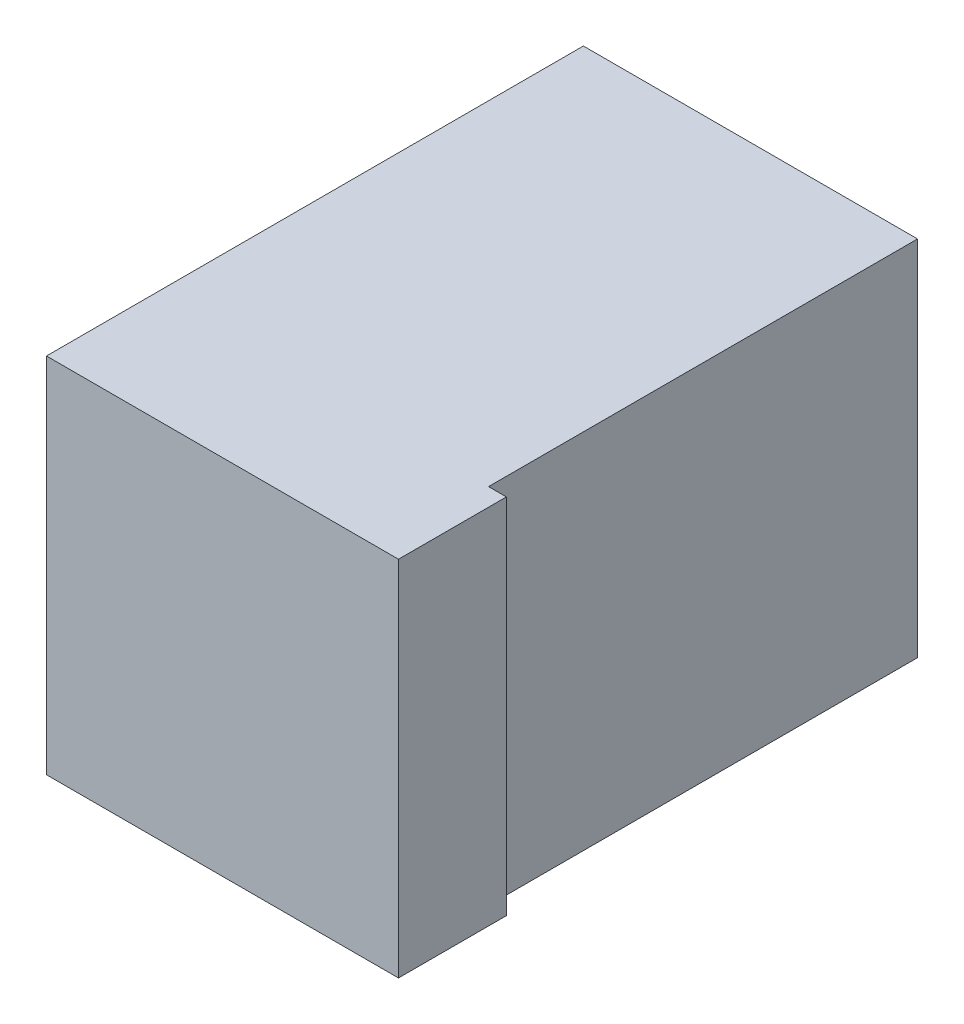
ISO-10303-21;
HEADER;
FILE_DESCRIPTION(('STEP AP214'),'2;1');
FILE_NAME('part.step','',(''),(''),'','','');
FILE_SCHEMA(('AUTOMOTIVE_DESIGN { 1 0 10303 214 1 1 1 1 }'));
ENDSEC;
DATA;
#1=APPLICATION_CONTEXT('core data for automotive mechanical design processes');
#2=APPLICATION_PROTOCOL_DEFINITION('international standard','automotive_design',2000,#1);
#3=PRODUCT_CONTEXT('',#1,'mechanical');
#4=PRODUCT('Part','Part','',(#3));
#5=PRODUCT_RELATED_PRODUCT_CATEGORY('part','',(#4));
#6=PRODUCT_DEFINITION_FORMATION('','',#4);
#7=PRODUCT_DEFINITION_CONTEXT('part definition',#1,'design');
#8=PRODUCT_DEFINITION('design','',#6,#7);
#9=PRODUCT_DEFINITION_SHAPE('','',#8);
#10=(LENGTH_UNIT() NAMED_UNIT(*) SI_UNIT(.MILLI.,.METRE.));
#11=(NAMED_UNIT(*) PLANE_ANGLE_UNIT() SI_UNIT($,.RADIAN.));
#12=(NAMED_UNIT(*) SI_UNIT($,.STERADIAN.) SOLID_ANGLE_UNIT());
#13=UNCERTAINTY_MEASURE_WITH_UNIT(LENGTH_MEASURE(1.E-05),#10,'distance_accuracy_value','');
#14=(GEOMETRIC_REPRESENTATION_CONTEXT(3) GLOBAL_UNCERTAINTY_ASSIGNED_CONTEXT((#13)) GLOBAL_UNIT_ASSIGNED_CONTEXT((#10,
#11,#12)) REPRESENTATION_CONTEXT('',''));
#15=CARTESIAN_POINT('',(0.,0.,0.));
#16=DIRECTION('',(0.,0.,1.));
#17=DIRECTION('',(1.,0.,0.));
#18=AXIS2_PLACEMENT_3D('',#15,#16,#17);
#19=CARTESIAN_POINT('',(0.,0.,151.));
#20=DIRECTION('',(-1.,0.,0.));
#21=DIRECTION('',(0.,-1.,0.));
#22=AXIS2_PLACEMENT_3D('',#19,#20,#21);
#23=PLANE('',#22);
#24=DIRECTION('',(0.,0.,-1.));
#25=VECTOR('',#24,1.);
#26=CARTESIAN_POINT('',(0.,-102.,151.));
#27=LINE('',#26,#25);
#28=CARTESIAN_POINT('',(0.,-102.,151.));
#29=VERTEX_POINT('',#28);
#30=CARTESIAN_POINT('',(0.,-102.,120.65));
#31=VERTEX_POINT('',#30);
#32=EDGE_CURVE('E114',#29,#31,#27,.T.);
#33=ORIENTED_EDGE('',*,*,#32,.T.);
#34=DIRECTION('',(0.,-1.,0.));
#35=VECTOR('',#34,1.);
#36=CARTESIAN_POINT('',(0.,50.4,120.65));
#37=LINE('',#36,#35);
#38=CARTESIAN_POINT('',(0.,0.,120.65));
#39=VERTEX_POINT('',#38);
#40=EDGE_CURVE('E99',#39,#31,#37,.T.);
#41=ORIENTED_EDGE('',*,*,#40,.F.);
#42=DIRECTION('',(0.,0.,-1.));
#43=VECTOR('',#42,1.);
#44=CARTESIAN_POINT('',(0.,0.,151.));
#45=LINE('',#44,#43);
#46=CARTESIAN_POINT('',(0.,0.,151.));
#47=VERTEX_POINT('',#46);
#48=EDGE_CURVE('E44',#47,#39,#45,.T.);
#49=ORIENTED_EDGE('',*,*,#48,.F.);
#50=DIRECTION('',(0.,1.,0.));
#51=VECTOR('',#50,1.);
#52=CARTESIAN_POINT('',(0.,0.,151.));
#53=LINE('',#52,#51);
#54=EDGE_CURVE('E117',#29,#47,#53,.T.);
#55=ORIENTED_EDGE('',*,*,#54,.F.);
#56=EDGE_LOOP('',(#33,#41,#49,#55));
#57=FACE_BOUND('',#56,.T.);
#58=ADVANCED_FACE('F37',(#57),#23,.F.);
#59=CARTESIAN_POINT('',(0.,0.,151.));
#60=DIRECTION('',(0.,-1.,0.));
#61=DIRECTION('',(0.,0.,-1.));
#62=AXIS2_PLACEMENT_3D('',#59,#60,#61);
#63=PLANE('',#62);
#64=DIRECTION('',(-1.,0.,0.));
#65=VECTOR('',#64,1.);
#66=CARTESIAN_POINT('',(0.,0.,120.65));
#67=LINE('',#66,#65);
#68=CARTESIAN_POINT('',(-5.02,0.,120.65));
#69=VERTEX_POINT('',#68);
#70=EDGE_CURVE('E105',#39,#69,#67,.T.);
#71=ORIENTED_EDGE('',*,*,#70,.T.);
#72=DIRECTION('',(0.,0.,-1.));
#73=VECTOR('',#72,1.);
#74=CARTESIAN_POINT('',(-5.02,0.,151.));
#75=LINE('',#74,#73);
#76=CARTESIAN_POINT('',(-5.02,0.,0.));
#77=VERTEX_POINT('',#76);
#78=EDGE_CURVE('E130',#69,#77,#75,.T.);
#79=ORIENTED_EDGE('',*,*,#78,.T.);
#80=DIRECTION('',(-1.,0.,0.));
#81=VECTOR('',#80,1.);
#82=CARTESIAN_POINT('',(0.,0.,0.));
#83=LINE('',#82,#81);
#84=CARTESIAN_POINT('',(-99.,0.,0.));
#85=VERTEX_POINT('',#84);
#86=EDGE_CURVE('E132',#77,#85,#83,.T.);
#87=ORIENTED_EDGE('',*,*,#86,.T.);
#88=DIRECTION('',(0.,0.,-1.));
#89=VECTOR('',#88,1.);
#90=CARTESIAN_POINT('',(-99.,0.,151.));
#91=LINE('',#90,#89);
#92=CARTESIAN_POINT('',(-99.,0.,151.));
#93=VERTEX_POINT('',#92);
#94=EDGE_CURVE('E120',#93,#85,#91,.T.);
#95=ORIENTED_EDGE('',*,*,#94,.F.);
#96=DIRECTION('',(-1.,0.,0.));
#97=VECTOR('',#96,1.);
#98=CARTESIAN_POINT('',(0.,0.,151.));
#99=LINE('',#98,#97);
#100=EDGE_CURVE('E83',#47,#93,#99,.T.);
#101=ORIENTED_EDGE('',*,*,#100,.F.);
#102=ORIENTED_EDGE('',*,*,#48,.T.);
#103=EDGE_LOOP('',(#71,#79,#87,#95,#101,#102));
#104=FACE_BOUND('',#103,.T.);
#105=ADVANCED_FACE('F128',(#104),#63,.F.);
#106=CARTESIAN_POINT('',(-99.,0.,151.));
#107=DIRECTION('',(1.,0.,0.));
#108=DIRECTION('',(0.,1.,0.));
#109=AXIS2_PLACEMENT_3D('',#106,#107,#108);
#110=PLANE('',#109);
#111=DIRECTION('',(0.,-1.,0.));
#112=VECTOR('',#111,1.);
#113=CARTESIAN_POINT('',(-99.,0.,0.));
#114=LINE('',#113,#112);
#115=CARTESIAN_POINT('',(-99.,-102.,0.));
#116=VERTEX_POINT('',#115);
#117=EDGE_CURVE('E75',#85,#116,#114,.T.);
#118=ORIENTED_EDGE('',*,*,#117,.T.);
#119=DIRECTION('',(0.,0.,-1.));
#120=VECTOR('',#119,1.);
#121=CARTESIAN_POINT('',(-99.,-102.,151.));
#122=LINE('',#121,#120);
#123=CARTESIAN_POINT('',(-99.,-102.,151.));
#124=VERTEX_POINT('',#123);
#125=EDGE_CURVE('E118',#124,#116,#122,.T.);
#126=ORIENTED_EDGE('',*,*,#125,.F.);
#127=DIRECTION('',(0.,-1.,0.));
#128=VECTOR('',#127,1.);
#129=CARTESIAN_POINT('',(-99.,0.,151.));
#130=LINE('',#129,#128);
#131=EDGE_CURVE('E122',#93,#124,#130,.T.);
#132=ORIENTED_EDGE('',*,*,#131,.F.);
#133=ORIENTED_EDGE('',*,*,#94,.T.);
#134=EDGE_LOOP('',(#118,#126,#132,#133));
#135=FACE_BOUND('',#134,.T.);
#136=ADVANCED_FACE('F155',(#135),#110,.F.);
#137=CARTESIAN_POINT('',(0.,-102.,151.));
#138=DIRECTION('',(0.,1.,0.));
#139=DIRECTION('',(-1.,0.,0.));
#140=AXIS2_PLACEMENT_3D('',#137,#138,#139);
#141=PLANE('',#140);
#142=DIRECTION('',(1.,0.,0.));
#143=VECTOR('',#142,1.);
#144=CARTESIAN_POINT('',(0.,-102.,0.));
#145=LINE('',#144,#143);
#146=CARTESIAN_POINT('',(-5.01999999999998,-102.,0.));
#147=VERTEX_POINT('',#146);
#148=EDGE_CURVE('E125',#116,#147,#145,.T.);
#149=ORIENTED_EDGE('',*,*,#148,.T.);
#150=DIRECTION('',(0.,0.,-1.));
#151=VECTOR('',#150,1.);
#152=CARTESIAN_POINT('',(-5.01999999999998,-102.,0.));
#153=LINE('',#152,#151);
#154=CARTESIAN_POINT('',(-5.01999999999998,-102.,120.65));
#155=VERTEX_POINT('',#154);
#156=EDGE_CURVE('E50',#155,#147,#153,.T.);
#157=ORIENTED_EDGE('',*,*,#156,.F.);
#158=DIRECTION('',(-1.,0.,0.));
#159=VECTOR('',#158,1.);
#160=CARTESIAN_POINT('',(0.,-102.,120.65));
#161=LINE('',#160,#159);
#162=EDGE_CURVE('E103',#31,#155,#161,.T.);
#163=ORIENTED_EDGE('',*,*,#162,.F.);
#164=ORIENTED_EDGE('',*,*,#32,.F.);
#165=DIRECTION('',(1.,0.,0.));
#166=VECTOR('',#165,1.);
#167=CARTESIAN_POINT('',(0.,-102.,151.));
#168=LINE('',#167,#166);
#169=EDGE_CURVE('E59',#124,#29,#168,.T.);
#170=ORIENTED_EDGE('',*,*,#169,.F.);
#171=ORIENTED_EDGE('',*,*,#125,.T.);
#172=EDGE_LOOP('',(#149,#157,#163,#164,#170,#171));
#173=FACE_BOUND('',#172,.T.);
#174=ADVANCED_FACE('F113',(#173),#141,.F.);
#175=CARTESIAN_POINT('',(0.,0.,151.));
#176=DIRECTION('',(0.,0.,-1.));
#177=DIRECTION('',(-1.,0.,0.));
#178=AXIS2_PLACEMENT_3D('',#175,#176,#177);
#179=PLANE('',#178);
#180=ORIENTED_EDGE('',*,*,#54,.T.);
#181=ORIENTED_EDGE('',*,*,#100,.T.);
#182=ORIENTED_EDGE('',*,*,#131,.T.);
#183=ORIENTED_EDGE('',*,*,#169,.T.);
#184=EDGE_LOOP('',(#180,#181,#182,#183));
#185=FACE_BOUND('',#184,.T.);
#186=ADVANCED_FACE('F163',(#185),#179,.F.);
#187=CARTESIAN_POINT('',(0.,0.,0.));
#188=DIRECTION('',(0.,0.,-1.));
#189=DIRECTION('',(-1.,0.,0.));
#190=AXIS2_PLACEMENT_3D('',#187,#188,#189);
#191=PLANE('',#190);
#192=DIRECTION('',(0.,1.,0.));
#193=VECTOR('',#192,1.);
#194=CARTESIAN_POINT('',(-5.02,0.,0.));
#195=LINE('',#194,#193);
#196=EDGE_CURVE('E11',#147,#77,#195,.T.);
#197=ORIENTED_EDGE('',*,*,#196,.F.);
#198=ORIENTED_EDGE('',*,*,#148,.F.);
#199=ORIENTED_EDGE('',*,*,#117,.F.);
#200=ORIENTED_EDGE('',*,*,#86,.F.);
#201=EDGE_LOOP('',(#197,#198,#199,#200));
#202=FACE_BOUND('',#201,.T.);
#203=ADVANCED_FACE('F141',(#202),#191,.T.);
#204=CARTESIAN_POINT('',(0.,50.4,120.65));
#205=DIRECTION('',(0.,0.,1.));
#206=DIRECTION('',(1.,0.,0.));
#207=AXIS2_PLACEMENT_3D('',#204,#205,#206);
#208=PLANE('',#207);
#209=ORIENTED_EDGE('',*,*,#40,.T.);
#210=ORIENTED_EDGE('',*,*,#162,.T.);
#211=DIRECTION('',(0.,-1.,0.));
#212=VECTOR('',#211,1.);
#213=CARTESIAN_POINT('',(-5.02,50.4,120.65));
#214=LINE('',#213,#212);
#215=EDGE_CURVE('E109',#69,#155,#214,.T.);
#216=ORIENTED_EDGE('',*,*,#215,.F.);
#217=ORIENTED_EDGE('',*,*,#70,.F.);
#218=EDGE_LOOP('',(#209,#210,#216,#217));
#219=FACE_BOUND('',#218,.T.);
#220=ADVANCED_FACE('F101',(#219),#208,.F.);
#221=CARTESIAN_POINT('',(-5.02,50.4,0.));
#222=DIRECTION('',(-1.,0.,0.));
#223=DIRECTION('',(0.,-1.,0.));
#224=AXIS2_PLACEMENT_3D('',#221,#222,#223);
#225=PLANE('',#224);
#226=ORIENTED_EDGE('',*,*,#215,.T.);
#227=ORIENTED_EDGE('',*,*,#156,.T.);
#228=ORIENTED_EDGE('',*,*,#196,.T.);
#229=ORIENTED_EDGE('',*,*,#78,.F.);
#230=EDGE_LOOP('',(#226,#227,#228,#229));
#231=FACE_BOUND('',#230,.T.);
#232=ADVANCED_FACE('F142',(#231),#225,.F.);
#233=CLOSED_SHELL('',(#58,#105,#136,#174,#186,#203,#220,#232));
#234=MANIFOLD_SOLID_BREP('B2',#233);
#235=ADVANCED_BREP_SHAPE_REPRESENTATION('',(#18,#234),#14);
#236=SHAPE_DEFINITION_REPRESENTATION(#9,#235);
ENDSEC;
END-ISO-10303-21;
